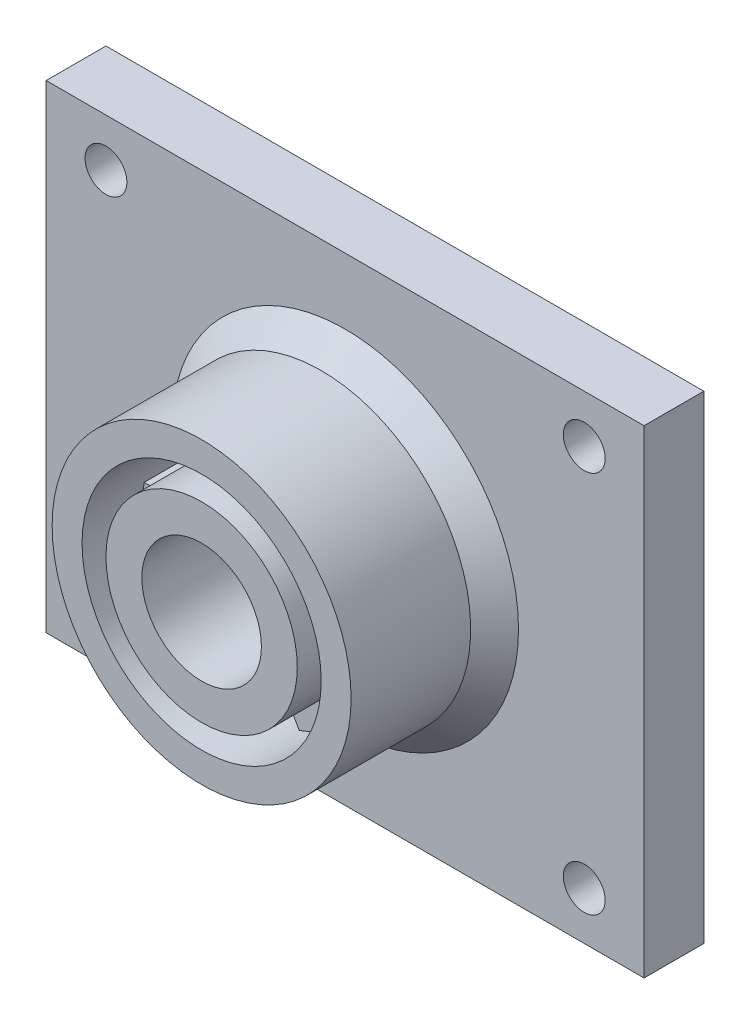
ISO-10303-21;
HEADER;
FILE_DESCRIPTION(('STEP AP214'),'2;1');
FILE_NAME('part.step','',(''),(''),'','','');
FILE_SCHEMA(('AUTOMOTIVE_DESIGN { 1 0 10303 214 1 1 1 1 }'));
ENDSEC;
DATA;
#1=APPLICATION_CONTEXT('core data for automotive mechanical design processes');
#2=APPLICATION_PROTOCOL_DEFINITION('international standard','automotive_design',2000,#1);
#3=PRODUCT_CONTEXT('',#1,'mechanical');
#4=PRODUCT('Part','Part','',(#3));
#5=PRODUCT_RELATED_PRODUCT_CATEGORY('part','',(#4));
#6=PRODUCT_DEFINITION_FORMATION('','',#4);
#7=PRODUCT_DEFINITION_CONTEXT('part definition',#1,'design');
#8=PRODUCT_DEFINITION('design','',#6,#7);
#9=PRODUCT_DEFINITION_SHAPE('','',#8);
#10=(LENGTH_UNIT() NAMED_UNIT(*) SI_UNIT(.MILLI.,.METRE.));
#11=(NAMED_UNIT(*) PLANE_ANGLE_UNIT() SI_UNIT($,.RADIAN.));
#12=(NAMED_UNIT(*) SI_UNIT($,.STERADIAN.) SOLID_ANGLE_UNIT());
#13=UNCERTAINTY_MEASURE_WITH_UNIT(LENGTH_MEASURE(1.E-05),#10,'distance_accuracy_value','');
#14=(GEOMETRIC_REPRESENTATION_CONTEXT(3) GLOBAL_UNCERTAINTY_ASSIGNED_CONTEXT((#13)) GLOBAL_UNIT_ASSIGNED_CONTEXT((#10,
#11,#12)) REPRESENTATION_CONTEXT('',''));
#15=CARTESIAN_POINT('',(0.,0.,0.));
#16=DIRECTION('',(0.,0.,1.));
#17=DIRECTION('',(1.,0.,0.));
#18=AXIS2_PLACEMENT_3D('',#15,#16,#17);
#19=CARTESIAN_POINT('',(0.,0.,9.5));
#20=DIRECTION('',(0.,0.,1.));
#21=DIRECTION('',(1.,0.,0.));
#22=AXIS2_PLACEMENT_3D('',#19,#20,#21);
#23=PLANE('',#22);
#24=DIRECTION('',(-0.499999999999868,0.866025403784515,0.));
#25=VECTOR('',#24,1.);
#26=CARTESIAN_POINT('',(1.73205080756903,0.999999999999735,9.5));
#27=LINE('',#26,#25);
#28=CARTESIAN_POINT('',(6.63103029313409,-7.48528137423958,9.5));
#29=VERTEX_POINT('',#28);
#30=CARTESIAN_POINT('',(5.60503415377542,-5.70820393250023,9.5));
#31=VERTEX_POINT('',#30);
#32=EDGE_CURVE('E508',#29,#31,#27,.T.);
#33=ORIENTED_EDGE('',*,*,#32,.T.);
#34=CARTESIAN_POINT('',(0.,0.,9.5));
#35=DIRECTION('',(0.,0.,1.));
#36=DIRECTION('',(1.,0.,0.));
#37=AXIS2_PLACEMENT_3D('',#34,#35,#36);
#38=CIRCLE('',#37,8.);
#39=CARTESIAN_POINT('',(2.14093253863736,-7.7082039324997,9.5));
#40=VERTEX_POINT('',#39);
#41=EDGE_CURVE('E249',#31,#40,#38,.F.);
#42=ORIENTED_EDGE('',*,*,#41,.T.);
#43=DIRECTION('',(-0.499999999999868,0.866025403784515,0.));
#44=VECTOR('',#43,1.);
#45=CARTESIAN_POINT('',(-1.73205080756903,-0.999999999999738,9.5));
#46=LINE('',#45,#44);
#47=CARTESIAN_POINT('',(3.16692867799603,-9.48528137423905,9.5));
#48=VERTEX_POINT('',#47);
#49=EDGE_CURVE('E505',#48,#40,#46,.T.);
#50=ORIENTED_EDGE('',*,*,#49,.F.);
#51=CARTESIAN_POINT('',(0.,0.,9.5));
#52=DIRECTION('',(0.,0.,1.));
#53=DIRECTION('',(1.,0.,0.));
#54=AXIS2_PLACEMENT_3D('',#51,#52,#53);
#55=CIRCLE('',#54,10.);
#56=EDGE_CURVE('E522',#48,#29,#55,.T.);
#57=ORIENTED_EDGE('',*,*,#56,.T.);
#58=EDGE_LOOP('',(#33,#42,#50,#57));
#59=FACE_BOUND('',#58,.T.);
#60=ADVANCED_FACE('F46',(#59),#23,.T.);
#61=DIRECTION('',(0.500000000000165,0.866025403784344,0.));
#62=VECTOR('',#61,1.);
#63=CARTESIAN_POINT('',(1.73205080756869,-1.00000000000033,9.5));
#64=LINE('',#63,#62);
#65=CARTESIAN_POINT('',(-3.16692867799928,-9.48528137423797,9.5));
#66=VERTEX_POINT('',#65);
#67=CARTESIAN_POINT('',(-2.14093253864,-7.70820393249896,9.5));
#68=VERTEX_POINT('',#67);
#69=EDGE_CURVE('E500',#66,#68,#64,.T.);
#70=ORIENTED_EDGE('',*,*,#69,.T.);
#71=CARTESIAN_POINT('',(-5.60503415377738,-5.7082039324983,9.5));
#72=VERTEX_POINT('',#71);
#73=EDGE_CURVE('E357',#68,#72,#38,.F.);
#74=ORIENTED_EDGE('',*,*,#73,.T.);
#75=DIRECTION('',(0.500000000000166,0.866025403784343,0.));
#76=VECTOR('',#75,1.);
#77=CARTESIAN_POINT('',(-1.73205080756868,1.00000000000033,9.5));
#78=LINE('',#77,#76);
#79=CARTESIAN_POINT('',(-6.63103029313666,-7.48528137423731,9.5));
#80=VERTEX_POINT('',#79);
#81=EDGE_CURVE('E497',#80,#72,#78,.T.);
#82=ORIENTED_EDGE('',*,*,#81,.F.);
#83=EDGE_CURVE('E491',#80,#66,#55,.T.);
#84=ORIENTED_EDGE('',*,*,#83,.T.);
#85=EDGE_LOOP('',(#70,#74,#82,#84));
#86=FACE_BOUND('',#85,.T.);
#87=ADVANCED_FACE('F529',(#86),#23,.T.);
#88=DIRECTION('',(1.,0.,0.));
#89=VECTOR('',#88,1.);
#90=CARTESIAN_POINT('',(0.,-2.,9.5));
#91=LINE('',#90,#89);
#92=CARTESIAN_POINT('',(-9.79795897113271,-2.,9.5));
#93=VERTEX_POINT('',#92);
#94=CARTESIAN_POINT('',(-7.74596669241483,-2.,9.5));
#95=VERTEX_POINT('',#94);
#96=EDGE_CURVE('E450',#93,#95,#91,.T.);
#97=ORIENTED_EDGE('',*,*,#96,.T.);
#98=CARTESIAN_POINT('',(-7.74596669241483,2.,9.5));
#99=VERTEX_POINT('',#98);
#100=EDGE_CURVE('E362',#95,#99,#38,.F.);
#101=ORIENTED_EDGE('',*,*,#100,.T.);
#102=DIRECTION('',(1.,0.,0.));
#103=VECTOR('',#102,1.);
#104=CARTESIAN_POINT('',(0.,2.00000000000001,9.5));
#105=LINE('',#104,#103);
#106=CARTESIAN_POINT('',(-9.79795897113271,2.,9.5));
#107=VERTEX_POINT('',#106);
#108=EDGE_CURVE('E294',#107,#99,#105,.T.);
#109=ORIENTED_EDGE('',*,*,#108,.F.);
#110=EDGE_CURVE('E485',#107,#93,#55,.T.);
#111=ORIENTED_EDGE('',*,*,#110,.T.);
#112=EDGE_LOOP('',(#97,#101,#109,#111));
#113=FACE_BOUND('',#112,.T.);
#114=ADVANCED_FACE('F487',(#113),#23,.T.);
#115=DIRECTION('',(0.499999999999967,-0.866025403784458,0.));
#116=VECTOR('',#115,1.);
#117=CARTESIAN_POINT('',(-1.73205080756891,-0.999999999999931,9.5));
#118=LINE('',#117,#116);
#119=CARTESIAN_POINT('',(-6.63103029313494,7.48528137423883,9.5));
#120=VERTEX_POINT('',#119);
#121=CARTESIAN_POINT('',(-5.60503415377607,5.70820393249959,9.5));
#122=VERTEX_POINT('',#121);
#123=EDGE_CURVE('E398',#120,#122,#118,.T.);
#124=ORIENTED_EDGE('',*,*,#123,.T.);
#125=CARTESIAN_POINT('',(-2.14093253863824,7.70820393249945,9.5));
#126=VERTEX_POINT('',#125);
#127=EDGE_CURVE('E367',#122,#126,#38,.F.);
#128=ORIENTED_EDGE('',*,*,#127,.T.);
#129=DIRECTION('',(0.499999999999967,-0.866025403784458,0.));
#130=VECTOR('',#129,1.);
#131=CARTESIAN_POINT('',(1.73205080756892,0.999999999999939,9.5));
#132=LINE('',#131,#130);
#133=CARTESIAN_POINT('',(-3.16692867799711,9.48528137423869,9.5));
#134=VERTEX_POINT('',#133);
#135=EDGE_CURVE('E392',#134,#126,#132,.T.);
#136=ORIENTED_EDGE('',*,*,#135,.F.);
#137=EDGE_CURVE('E490',#134,#120,#55,.T.);
#138=ORIENTED_EDGE('',*,*,#137,.T.);
#139=EDGE_LOOP('',(#124,#128,#136,#138));
#140=FACE_BOUND('',#139,.T.);
#141=ADVANCED_FACE('F549',(#140),#23,.T.);
#142=DIRECTION('',(-0.500000000000066,-0.866025403784401,0.));
#143=VECTOR('',#142,1.);
#144=CARTESIAN_POINT('',(-1.73205080756879,1.00000000000013,9.5));
#145=LINE('',#144,#143);
#146=CARTESIAN_POINT('',(3.16692867799821,9.48528137423833,9.5));
#147=VERTEX_POINT('',#146);
#148=CARTESIAN_POINT('',(2.14093253863914,7.7082039324992,9.5));
#149=VERTEX_POINT('',#148);
#150=EDGE_CURVE('E383',#147,#149,#145,.T.);
#151=ORIENTED_EDGE('',*,*,#150,.T.);
#152=CARTESIAN_POINT('',(5.60503415377674,5.70820393249893,9.5));
#153=VERTEX_POINT('',#152);
#154=EDGE_CURVE('E246',#149,#153,#38,.F.);
#155=ORIENTED_EDGE('',*,*,#154,.T.);
#156=DIRECTION('',(-0.500000000000066,-0.866025403784401,0.));
#157=VECTOR('',#156,1.);
#158=CARTESIAN_POINT('',(1.73205080756882,-1.00000000000014,9.5));
#159=LINE('',#158,#157);
#160=CARTESIAN_POINT('',(6.63103029313582,7.48528137423805,9.5));
#161=VERTEX_POINT('',#160);
#162=EDGE_CURVE('E256',#161,#153,#159,.T.);
#163=ORIENTED_EDGE('',*,*,#162,.F.);
#164=EDGE_CURVE('E247',#161,#147,#55,.T.);
#165=ORIENTED_EDGE('',*,*,#164,.T.);
#166=EDGE_LOOP('',(#151,#155,#163,#165));
#167=FACE_BOUND('',#166,.T.);
#168=ADVANCED_FACE('F380',(#167),#23,.T.);
#169=CARTESIAN_POINT('',(0.,0.,2.5));
#170=DIRECTION('',(0.,0.,-1.));
#171=DIRECTION('',(-1.,0.,0.));
#172=AXIS2_PLACEMENT_3D('',#169,#170,#171);
#173=PLANE('',#172);
#174=CARTESIAN_POINT('',(0.,0.,2.5));
#175=DIRECTION('',(0.,0.,-1.));
#176=DIRECTION('',(-1.,0.,0.));
#177=AXIS2_PLACEMENT_3D('',#174,#175,#176);
#178=CIRCLE('',#177,14.5);
#179=CARTESIAN_POINT('',(-14.5,0.,2.5));
#180=VERTEX_POINT('',#179);
#181=EDGE_CURVE('E12',#180,#180,#178,.T.);
#182=ORIENTED_EDGE('',*,*,#181,.T.);
#183=EDGE_LOOP('',(#182));
#184=FACE_BOUND('',#183,.T.);
#185=DIRECTION('',(0.,1.,0.));
#186=VECTOR('',#185,1.);
#187=CARTESIAN_POINT('',(25.,-20.,2.5));
#188=LINE('',#187,#186);
#189=CARTESIAN_POINT('',(25.,-20.,2.5));
#190=VERTEX_POINT('',#189);
#191=CARTESIAN_POINT('',(25.,20.,2.5));
#192=VERTEX_POINT('',#191);
#193=EDGE_CURVE('E326',#190,#192,#188,.T.);
#194=ORIENTED_EDGE('',*,*,#193,.T.);
#195=DIRECTION('',(-1.,0.,0.));
#196=VECTOR('',#195,1.);
#197=CARTESIAN_POINT('',(-25.,20.,2.5));
#198=LINE('',#197,#196);
#199=CARTESIAN_POINT('',(-25.,20.,2.5));
#200=VERTEX_POINT('',#199);
#201=EDGE_CURVE('E329',#192,#200,#198,.T.);
#202=ORIENTED_EDGE('',*,*,#201,.T.);
#203=DIRECTION('',(0.,-1.,0.));
#204=VECTOR('',#203,1.);
#205=CARTESIAN_POINT('',(-25.,-20.,2.5));
#206=LINE('',#205,#204);
#207=CARTESIAN_POINT('',(-25.,-20.,2.5));
#208=VERTEX_POINT('',#207);
#209=EDGE_CURVE('E332',#200,#208,#206,.T.);
#210=ORIENTED_EDGE('',*,*,#209,.T.);
#211=DIRECTION('',(1.,0.,0.));
#212=VECTOR('',#211,1.);
#213=CARTESIAN_POINT('',(-25.,-20.,2.5));
#214=LINE('',#213,#212);
#215=EDGE_CURVE('E334',#208,#190,#214,.T.);
#216=ORIENTED_EDGE('',*,*,#215,.T.);
#217=EDGE_LOOP('',(#194,#202,#210,#216));
#218=FACE_BOUND('',#217,.T.);
#219=CARTESIAN_POINT('',(-20.,16.,2.5));
#220=DIRECTION('',(0.,0.,1.));
#221=DIRECTION('',(1.,0.,0.));
#222=AXIS2_PLACEMENT_3D('',#219,#220,#221);
#223=CIRCLE('',#222,1.75);
#224=CARTESIAN_POINT('',(-18.25,16.,2.5));
#225=VERTEX_POINT('',#224);
#226=EDGE_CURVE('E320',#225,#225,#223,.T.);
#227=ORIENTED_EDGE('',*,*,#226,.F.);
#228=EDGE_LOOP('',(#227));
#229=FACE_BOUND('',#228,.T.);
#230=CARTESIAN_POINT('',(20.,16.,2.5));
#231=DIRECTION('',(0.,0.,1.));
#232=DIRECTION('',(1.,0.,0.));
#233=AXIS2_PLACEMENT_3D('',#230,#231,#232);
#234=CIRCLE('',#233,1.75);
#235=CARTESIAN_POINT('',(21.75,16.,2.5));
#236=VERTEX_POINT('',#235);
#237=EDGE_CURVE('E314',#236,#236,#234,.T.);
#238=ORIENTED_EDGE('',*,*,#237,.F.);
#239=EDGE_LOOP('',(#238));
#240=FACE_BOUND('',#239,.T.);
#241=CARTESIAN_POINT('',(20.,-16.,2.5));
#242=DIRECTION('',(0.,0.,1.));
#243=DIRECTION('',(1.,0.,0.));
#244=AXIS2_PLACEMENT_3D('',#241,#242,#243);
#245=CIRCLE('',#244,1.75);
#246=CARTESIAN_POINT('',(21.75,-16.,2.5));
#247=VERTEX_POINT('',#246);
#248=EDGE_CURVE('E308',#247,#247,#245,.T.);
#249=ORIENTED_EDGE('',*,*,#248,.F.);
#250=EDGE_LOOP('',(#249));
#251=FACE_BOUND('',#250,.T.);
#252=CARTESIAN_POINT('',(-20.,-16.,2.5));
#253=DIRECTION('',(0.,0.,1.));
#254=DIRECTION('',(1.,0.,0.));
#255=AXIS2_PLACEMENT_3D('',#252,#253,#254);
#256=CIRCLE('',#255,1.75);
#257=CARTESIAN_POINT('',(-18.25,-16.,2.5));
#258=VERTEX_POINT('',#257);
#259=EDGE_CURVE('E300',#258,#258,#256,.T.);
#260=ORIENTED_EDGE('',*,*,#259,.F.);
#261=EDGE_LOOP('',(#260));
#262=FACE_BOUND('',#261,.T.);
#263=ADVANCED_FACE('F548',(#184,#218,#229,#240,#251,#262),#173,.F.);
#264=CARTESIAN_POINT('',(0.,0.,-2.5));
#265=DIRECTION('',(0.,0.,-1.));
#266=DIRECTION('',(-1.,0.,0.));
#267=AXIS2_PLACEMENT_3D('',#264,#265,#266);
#268=PLANE('',#267);
#269=CARTESIAN_POINT('',(20.,-16.,-2.5));
#270=DIRECTION('',(0.,0.,1.));
#271=DIRECTION('',(1.,0.,0.));
#272=AXIS2_PLACEMENT_3D('',#269,#270,#271);
#273=CIRCLE('',#272,1.75);
#274=CARTESIAN_POINT('',(21.75,-16.,-2.5));
#275=VERTEX_POINT('',#274);
#276=EDGE_CURVE('E303',#275,#275,#273,.T.);
#277=ORIENTED_EDGE('',*,*,#276,.T.);
#278=EDGE_LOOP('',(#277));
#279=FACE_BOUND('',#278,.T.);
#280=CARTESIAN_POINT('',(-20.,16.,-2.5));
#281=DIRECTION('',(0.,0.,1.));
#282=DIRECTION('',(1.,0.,0.));
#283=AXIS2_PLACEMENT_3D('',#280,#281,#282);
#284=CIRCLE('',#283,1.75);
#285=CARTESIAN_POINT('',(-18.25,16.,-2.5));
#286=VERTEX_POINT('',#285);
#287=EDGE_CURVE('E317',#286,#286,#284,.T.);
#288=ORIENTED_EDGE('',*,*,#287,.T.);
#289=EDGE_LOOP('',(#288));
#290=FACE_BOUND('',#289,.T.);
#291=DIRECTION('',(0.,1.,0.));
#292=VECTOR('',#291,1.);
#293=CARTESIAN_POINT('',(25.,-20.,-2.5));
#294=LINE('',#293,#292);
#295=CARTESIAN_POINT('',(25.,-20.,-2.5));
#296=VERTEX_POINT('',#295);
#297=CARTESIAN_POINT('',(25.,20.,-2.5));
#298=VERTEX_POINT('',#297);
#299=EDGE_CURVE('E323',#296,#298,#294,.T.);
#300=ORIENTED_EDGE('',*,*,#299,.F.);
#301=DIRECTION('',(1.,0.,0.));
#302=VECTOR('',#301,1.);
#303=CARTESIAN_POINT('',(-25.,-20.,-2.5));
#304=LINE('',#303,#302);
#305=CARTESIAN_POINT('',(-25.,-20.,-2.5));
#306=VERTEX_POINT('',#305);
#307=EDGE_CURVE('E330',#306,#296,#304,.T.);
#308=ORIENTED_EDGE('',*,*,#307,.F.);
#309=DIRECTION('',(0.,-1.,0.));
#310=VECTOR('',#309,1.);
#311=CARTESIAN_POINT('',(-25.,-20.,-2.5));
#312=LINE('',#311,#310);
#313=CARTESIAN_POINT('',(-25.,20.,-2.5));
#314=VERTEX_POINT('',#313);
#315=EDGE_CURVE('E341',#314,#306,#312,.T.);
#316=ORIENTED_EDGE('',*,*,#315,.F.);
#317=DIRECTION('',(-1.,0.,0.));
#318=VECTOR('',#317,1.);
#319=CARTESIAN_POINT('',(-25.,20.,-2.5));
#320=LINE('',#319,#318);
#321=EDGE_CURVE('E339',#298,#314,#320,.T.);
#322=ORIENTED_EDGE('',*,*,#321,.F.);
#323=EDGE_LOOP('',(#300,#308,#316,#322));
#324=FACE_BOUND('',#323,.T.);
#325=CARTESIAN_POINT('',(20.,16.,-2.5));
#326=DIRECTION('',(0.,0.,1.));
#327=DIRECTION('',(1.,0.,0.));
#328=AXIS2_PLACEMENT_3D('',#325,#326,#327);
#329=CIRCLE('',#328,1.75);
#330=CARTESIAN_POINT('',(21.75,16.,-2.5));
#331=VERTEX_POINT('',#330);
#332=EDGE_CURVE('E311',#331,#331,#329,.T.);
#333=ORIENTED_EDGE('',*,*,#332,.T.);
#334=EDGE_LOOP('',(#333));
#335=FACE_BOUND('',#334,.T.);
#336=CARTESIAN_POINT('',(-20.,-16.,-2.5));
#337=DIRECTION('',(0.,0.,1.));
#338=DIRECTION('',(1.,0.,0.));
#339=AXIS2_PLACEMENT_3D('',#336,#337,#338);
#340=CIRCLE('',#339,1.75);
#341=CARTESIAN_POINT('',(-18.25,-16.,-2.5));
#342=VERTEX_POINT('',#341);
#343=EDGE_CURVE('E304',#342,#342,#340,.T.);
#344=ORIENTED_EDGE('',*,*,#343,.T.);
#345=EDGE_LOOP('',(#344));
#346=FACE_BOUND('',#345,.T.);
#347=ADVANCED_FACE('F554',(#279,#290,#324,#335,#346),#268,.T.);
#348=CARTESIAN_POINT('',(25.,-20.,2.5));
#349=DIRECTION('',(-1.,0.,0.));
#350=DIRECTION('',(0.,0.,1.));
#351=AXIS2_PLACEMENT_3D('',#348,#349,#350);
#352=PLANE('',#351);
#353=ORIENTED_EDGE('',*,*,#299,.T.);
#354=DIRECTION('',(0.,0.,-1.));
#355=VECTOR('',#354,1.);
#356=CARTESIAN_POINT('',(25.,20.,2.5));
#357=LINE('',#356,#355);
#358=EDGE_CURVE('E352',#192,#298,#357,.T.);
#359=ORIENTED_EDGE('',*,*,#358,.F.);
#360=ORIENTED_EDGE('',*,*,#193,.F.);
#361=DIRECTION('',(0.,0.,-1.));
#362=VECTOR('',#361,1.);
#363=CARTESIAN_POINT('',(25.,-20.,2.5));
#364=LINE('',#363,#362);
#365=EDGE_CURVE('E336',#190,#296,#364,.T.);
#366=ORIENTED_EDGE('',*,*,#365,.T.);
#367=EDGE_LOOP('',(#353,#359,#360,#366));
#368=FACE_BOUND('',#367,.T.);
#369=ADVANCED_FACE('F676',(#368),#352,.F.);
#370=CARTESIAN_POINT('',(-25.,20.,2.5));
#371=DIRECTION('',(0.,-1.,0.));
#372=DIRECTION('',(0.,0.,-1.));
#373=AXIS2_PLACEMENT_3D('',#370,#371,#372);
#374=PLANE('',#373);
#375=ORIENTED_EDGE('',*,*,#321,.T.);
#376=DIRECTION('',(0.,0.,-1.));
#377=VECTOR('',#376,1.);
#378=CARTESIAN_POINT('',(-25.,20.,2.5));
#379=LINE('',#378,#377);
#380=EDGE_CURVE('E349',#200,#314,#379,.T.);
#381=ORIENTED_EDGE('',*,*,#380,.F.);
#382=ORIENTED_EDGE('',*,*,#201,.F.);
#383=ORIENTED_EDGE('',*,*,#358,.T.);
#384=EDGE_LOOP('',(#375,#381,#382,#383));
#385=FACE_BOUND('',#384,.T.);
#386=ADVANCED_FACE('F697',(#385),#374,.F.);
#387=CARTESIAN_POINT('',(-25.,-20.,2.5));
#388=DIRECTION('',(1.,0.,0.));
#389=DIRECTION('',(0.,0.,-1.));
#390=AXIS2_PLACEMENT_3D('',#387,#388,#389);
#391=PLANE('',#390);
#392=ORIENTED_EDGE('',*,*,#315,.T.);
#393=DIRECTION('',(0.,0.,-1.));
#394=VECTOR('',#393,1.);
#395=CARTESIAN_POINT('',(-25.,-20.,2.5));
#396=LINE('',#395,#394);
#397=EDGE_CURVE('E346',#208,#306,#396,.T.);
#398=ORIENTED_EDGE('',*,*,#397,.F.);
#399=ORIENTED_EDGE('',*,*,#209,.F.);
#400=ORIENTED_EDGE('',*,*,#380,.T.);
#401=EDGE_LOOP('',(#392,#398,#399,#400));
#402=FACE_BOUND('',#401,.T.);
#403=ADVANCED_FACE('F667',(#402),#391,.F.);
#404=CARTESIAN_POINT('',(-25.,-20.,2.5));
#405=DIRECTION('',(0.,1.,0.));
#406=DIRECTION('',(0.,0.,1.));
#407=AXIS2_PLACEMENT_3D('',#404,#405,#406);
#408=PLANE('',#407);
#409=ORIENTED_EDGE('',*,*,#307,.T.);
#410=ORIENTED_EDGE('',*,*,#365,.F.);
#411=ORIENTED_EDGE('',*,*,#215,.F.);
#412=ORIENTED_EDGE('',*,*,#397,.T.);
#413=EDGE_LOOP('',(#409,#410,#411,#412));
#414=FACE_BOUND('',#413,.T.);
#415=ADVANCED_FACE('F662',(#414),#408,.F.);
#416=CARTESIAN_POINT('',(-20.,16.,2.5));
#417=DIRECTION('',(0.,0.,-1.));
#418=DIRECTION('',(-1.,0.,0.));
#419=AXIS2_PLACEMENT_3D('',#416,#417,#418);
#420=CYLINDRICAL_SURFACE('',#419,1.75);
#421=ORIENTED_EDGE('',*,*,#226,.T.);
#422=EDGE_LOOP('',(#421));
#423=FACE_BOUND('',#422,.T.);
#424=ORIENTED_EDGE('',*,*,#287,.F.);
#425=EDGE_LOOP('',(#424));
#426=FACE_BOUND('',#425,.T.);
#427=ADVANCED_FACE('F659',(#423,#426),#420,.F.);
#428=CARTESIAN_POINT('',(20.,16.,2.5));
#429=DIRECTION('',(0.,0.,-1.));
#430=DIRECTION('',(-1.,0.,0.));
#431=AXIS2_PLACEMENT_3D('',#428,#429,#430);
#432=CYLINDRICAL_SURFACE('',#431,1.75);
#433=ORIENTED_EDGE('',*,*,#237,.T.);
#434=EDGE_LOOP('',(#433));
#435=FACE_BOUND('',#434,.T.);
#436=ORIENTED_EDGE('',*,*,#332,.F.);
#437=EDGE_LOOP('',(#436));
#438=FACE_BOUND('',#437,.T.);
#439=ADVANCED_FACE('F656',(#435,#438),#432,.F.);
#440=CARTESIAN_POINT('',(20.,-16.,2.5));
#441=DIRECTION('',(0.,0.,-1.));
#442=DIRECTION('',(-1.,0.,0.));
#443=AXIS2_PLACEMENT_3D('',#440,#441,#442);
#444=CYLINDRICAL_SURFACE('',#443,1.75);
#445=ORIENTED_EDGE('',*,*,#248,.T.);
#446=EDGE_LOOP('',(#445));
#447=FACE_BOUND('',#446,.T.);
#448=ORIENTED_EDGE('',*,*,#276,.F.);
#449=EDGE_LOOP('',(#448));
#450=FACE_BOUND('',#449,.T.);
#451=ADVANCED_FACE('F624',(#447,#450),#444,.F.);
#452=CARTESIAN_POINT('',(-20.,-16.,2.5));
#453=DIRECTION('',(0.,0.,-1.));
#454=DIRECTION('',(-1.,0.,0.));
#455=AXIS2_PLACEMENT_3D('',#452,#453,#454);
#456=CYLINDRICAL_SURFACE('',#455,1.75);
#457=ORIENTED_EDGE('',*,*,#259,.T.);
#458=EDGE_LOOP('',(#457));
#459=FACE_BOUND('',#458,.T.);
#460=ORIENTED_EDGE('',*,*,#343,.F.);
#461=EDGE_LOOP('',(#460));
#462=FACE_BOUND('',#461,.T.);
#463=ADVANCED_FACE('F617',(#459,#462),#456,.F.);
#464=CARTESIAN_POINT('',(0.,0.,9.5));
#465=DIRECTION('',(0.,0.,-1.));
#466=DIRECTION('',(-1.,0.,0.));
#467=AXIS2_PLACEMENT_3D('',#464,#465,#466);
#468=CYLINDRICAL_SURFACE('',#467,12.5);
#469=CARTESIAN_POINT('',(0.,0.,4.50000000000002));
#470=DIRECTION('',(0.,0.,-1.));
#471=DIRECTION('',(-1.,0.,0.));
#472=AXIS2_PLACEMENT_3D('',#469,#470,#471);
#473=CIRCLE('',#472,12.5);
#474=CARTESIAN_POINT('',(-12.5,0.,4.50000000000002));
#475=VERTEX_POINT('',#474);
#476=EDGE_CURVE('E54',#475,#475,#473,.F.);
#477=ORIENTED_EDGE('',*,*,#476,.T.);
#478=EDGE_LOOP('',(#477));
#479=FACE_BOUND('',#478,.T.);
#480=CARTESIAN_POINT('',(0.,0.,14.5));
#481=DIRECTION('',(0.,0.,1.));
#482=DIRECTION('',(1.,0.,0.));
#483=AXIS2_PLACEMENT_3D('',#480,#481,#482);
#484=CIRCLE('',#483,12.5);
#485=CARTESIAN_POINT('',(12.5,0.,14.5));
#486=VERTEX_POINT('',#485);
#487=EDGE_CURVE('E406',#486,#486,#484,.T.);
#488=ORIENTED_EDGE('',*,*,#487,.F.);
#489=EDGE_LOOP('',(#488));
#490=FACE_BOUND('',#489,.T.);
#491=ADVANCED_FACE('F615',(#479,#490),#468,.T.);
#492=CARTESIAN_POINT('',(0.,0.,14.5));
#493=DIRECTION('',(0.,0.,1.));
#494=DIRECTION('',(1.,0.,0.));
#495=AXIS2_PLACEMENT_3D('',#492,#493,#494);
#496=PLANE('',#495);
#497=CARTESIAN_POINT('',(0.,0.,14.5));
#498=DIRECTION('',(0.,0.,1.));
#499=DIRECTION('',(1.,0.,0.));
#500=AXIS2_PLACEMENT_3D('',#497,#498,#499);
#501=CIRCLE('',#500,10.);
#502=CARTESIAN_POINT('',(10.,0.,14.5));
#503=VERTEX_POINT('',#502);
#504=EDGE_CURVE('E606',#503,#503,#501,.T.);
#505=ORIENTED_EDGE('',*,*,#504,.F.);
#506=EDGE_LOOP('',(#505));
#507=FACE_BOUND('',#506,.T.);
#508=ORIENTED_EDGE('',*,*,#487,.T.);
#509=EDGE_LOOP('',(#508));
#510=FACE_BOUND('',#509,.T.);
#511=ADVANCED_FACE('F613',(#507,#510),#496,.T.);
#512=DIRECTION('',(-1.,1.14338320158036E-13,0.));
#513=VECTOR('',#512,1.);
#514=CARTESIAN_POINT('',(2.28676640316071E-13,1.99999999999999,2.5));
#515=LINE('',#514,#513);
#516=CARTESIAN_POINT('',(9.79795897113295,1.99999999999887,2.5));
#517=VERTEX_POINT('',#516);
#518=CARTESIAN_POINT('',(7.74596669241507,1.9999999999991,2.5));
#519=VERTEX_POINT('',#518);
#520=EDGE_CURVE('E261',#517,#519,#515,.T.);
#521=ORIENTED_EDGE('',*,*,#520,.F.);
#522=CARTESIAN_POINT('',(0.,0.,2.5));
#523=DIRECTION('',(0.,0.,1.));
#524=DIRECTION('',(1.,0.,0.));
#525=AXIS2_PLACEMENT_3D('',#522,#523,#524);
#526=CIRCLE('',#525,10.);
#527=CARTESIAN_POINT('',(6.63103029313581,7.48528137423806,2.5));
#528=VERTEX_POINT('',#527);
#529=EDGE_CURVE('E436',#517,#528,#526,.T.);
#530=ORIENTED_EDGE('',*,*,#529,.T.);
#531=DIRECTION('',(-0.500000000000066,-0.866025403784401,0.));
#532=VECTOR('',#531,1.);
#533=CARTESIAN_POINT('',(1.73205080756882,-1.00000000000014,2.5));
#534=LINE('',#533,#532);
#535=CARTESIAN_POINT('',(5.60503415377674,5.70820393249893,2.5));
#536=VERTEX_POINT('',#535);
#537=EDGE_CURVE('E434',#528,#536,#534,.T.);
#538=ORIENTED_EDGE('',*,*,#537,.T.);
#539=CARTESIAN_POINT('',(0.,0.,2.5));
#540=DIRECTION('',(0.,0.,1.));
#541=DIRECTION('',(1.,0.,0.));
#542=AXIS2_PLACEMENT_3D('',#539,#540,#541);
#543=CIRCLE('',#542,8.);
#544=EDGE_CURVE('E385',#519,#536,#543,.T.);
#545=ORIENTED_EDGE('',*,*,#544,.F.);
#546=EDGE_LOOP('',(#521,#530,#538,#545));
#547=FACE_BOUND('',#546,.T.);
#548=ADVANCED_FACE('F471',(#547),#173,.F.);
#549=DIRECTION('',(-0.500000000000066,-0.866025403784401,0.));
#550=VECTOR('',#549,1.);
#551=CARTESIAN_POINT('',(-1.73205080756879,1.00000000000013,2.5));
#552=LINE('',#551,#550);
#553=CARTESIAN_POINT('',(3.16692867799821,9.48528137423833,2.5));
#554=VERTEX_POINT('',#553);
#555=CARTESIAN_POINT('',(2.14093253863914,7.7082039324992,2.5));
#556=VERTEX_POINT('',#555);
#557=EDGE_CURVE('E437',#554,#556,#552,.T.);
#558=ORIENTED_EDGE('',*,*,#557,.F.);
#559=CARTESIAN_POINT('',(-3.16692867799711,9.48528137423869,2.5));
#560=VERTEX_POINT('',#559);
#561=EDGE_CURVE('E442',#554,#560,#526,.T.);
#562=ORIENTED_EDGE('',*,*,#561,.T.);
#563=DIRECTION('',(0.499999999999967,-0.866025403784458,0.));
#564=VECTOR('',#563,1.);
#565=CARTESIAN_POINT('',(1.73205080756892,0.999999999999939,2.5));
#566=LINE('',#565,#564);
#567=CARTESIAN_POINT('',(-2.14093253863824,7.70820393249945,2.5));
#568=VERTEX_POINT('',#567);
#569=EDGE_CURVE('E69',#560,#568,#566,.T.);
#570=ORIENTED_EDGE('',*,*,#569,.T.);
#571=EDGE_CURVE('E440',#556,#568,#543,.T.);
#572=ORIENTED_EDGE('',*,*,#571,.F.);
#573=EDGE_LOOP('',(#558,#562,#570,#572));
#574=FACE_BOUND('',#573,.T.);
#575=ADVANCED_FACE('F568',(#574),#173,.F.);
#576=DIRECTION('',(0.499999999999967,-0.866025403784458,0.));
#577=VECTOR('',#576,1.);
#578=CARTESIAN_POINT('',(-1.73205080756891,-0.999999999999931,2.5));
#579=LINE('',#578,#577);
#580=CARTESIAN_POINT('',(-6.63103029313494,7.48528137423883,2.5));
#581=VERTEX_POINT('',#580);
#582=CARTESIAN_POINT('',(-5.60503415377607,5.70820393249959,2.5));
#583=VERTEX_POINT('',#582);
#584=EDGE_CURVE('E443',#581,#583,#579,.T.);
#585=ORIENTED_EDGE('',*,*,#584,.F.);
#586=CARTESIAN_POINT('',(-9.79795897113271,2.,2.5));
#587=VERTEX_POINT('',#586);
#588=EDGE_CURVE('E418',#581,#587,#526,.T.);
#589=ORIENTED_EDGE('',*,*,#588,.T.);
#590=DIRECTION('',(1.,0.,0.));
#591=VECTOR('',#590,1.);
#592=CARTESIAN_POINT('',(0.,2.00000000000001,2.5));
#593=LINE('',#592,#591);
#594=CARTESIAN_POINT('',(-7.74596669241484,2.,2.5));
#595=VERTEX_POINT('',#594);
#596=EDGE_CURVE('E61',#587,#595,#593,.T.);
#597=ORIENTED_EDGE('',*,*,#596,.T.);
#598=EDGE_CURVE('E410',#583,#595,#543,.T.);
#599=ORIENTED_EDGE('',*,*,#598,.F.);
#600=EDGE_LOOP('',(#585,#589,#597,#599));
#601=FACE_BOUND('',#600,.T.);
#602=ADVANCED_FACE('F480',(#601),#173,.F.);
#603=DIRECTION('',(1.,0.,0.));
#604=VECTOR('',#603,1.);
#605=CARTESIAN_POINT('',(0.,-2.,2.5));
#606=LINE('',#605,#604);
#607=CARTESIAN_POINT('',(-9.79795897113271,-2.,2.5));
#608=VERTEX_POINT('',#607);
#609=CARTESIAN_POINT('',(-7.74596669241483,-2.,2.5));
#610=VERTEX_POINT('',#609);
#611=EDGE_CURVE('E402',#608,#610,#606,.T.);
#612=ORIENTED_EDGE('',*,*,#611,.F.);
#613=CARTESIAN_POINT('',(-6.63103029313666,-7.48528137423731,2.5));
#614=VERTEX_POINT('',#613);
#615=EDGE_CURVE('E414',#608,#614,#526,.T.);
#616=ORIENTED_EDGE('',*,*,#615,.T.);
#617=DIRECTION('',(0.500000000000166,0.866025403784343,0.));
#618=VECTOR('',#617,1.);
#619=CARTESIAN_POINT('',(-1.73205080756868,1.00000000000033,2.5));
#620=LINE('',#619,#618);
#621=CARTESIAN_POINT('',(-5.60503415377738,-5.70820393249831,2.5));
#622=VERTEX_POINT('',#621);
#623=EDGE_CURVE('E409',#614,#622,#620,.T.);
#624=ORIENTED_EDGE('',*,*,#623,.T.);
#625=EDGE_CURVE('E405',#610,#622,#543,.T.);
#626=ORIENTED_EDGE('',*,*,#625,.F.);
#627=EDGE_LOOP('',(#612,#616,#624,#626));
#628=FACE_BOUND('',#627,.T.);
#629=ADVANCED_FACE('F557',(#628),#173,.F.);
#630=DIRECTION('',(0.500000000000165,0.866025403784344,0.));
#631=VECTOR('',#630,1.);
#632=CARTESIAN_POINT('',(1.73205080756869,-1.00000000000033,2.5));
#633=LINE('',#632,#631);
#634=CARTESIAN_POINT('',(-3.16692867799929,-9.48528137423797,2.5));
#635=VERTEX_POINT('',#634);
#636=CARTESIAN_POINT('',(-2.14093253864001,-7.70820393249897,2.5));
#637=VERTEX_POINT('',#636);
#638=EDGE_CURVE('E417',#635,#637,#633,.T.);
#639=ORIENTED_EDGE('',*,*,#638,.F.);
#640=CARTESIAN_POINT('',(3.16692867799603,-9.48528137423905,2.5));
#641=VERTEX_POINT('',#640);
#642=EDGE_CURVE('E419',#635,#641,#526,.T.);
#643=ORIENTED_EDGE('',*,*,#642,.T.);
#644=DIRECTION('',(-0.499999999999868,0.866025403784515,0.));
#645=VECTOR('',#644,1.);
#646=CARTESIAN_POINT('',(-1.73205080756903,-0.999999999999738,2.5));
#647=LINE('',#646,#645);
#648=CARTESIAN_POINT('',(2.14093253863737,-7.7082039324997,2.5));
#649=VERTEX_POINT('',#648);
#650=EDGE_CURVE('E422',#641,#649,#647,.T.);
#651=ORIENTED_EDGE('',*,*,#650,.T.);
#652=EDGE_CURVE('E411',#637,#649,#543,.T.);
#653=ORIENTED_EDGE('',*,*,#652,.F.);
#654=EDGE_LOOP('',(#639,#643,#651,#653));
#655=FACE_BOUND('',#654,.T.);
#656=ADVANCED_FACE('F574',(#655),#173,.F.);
#657=DIRECTION('',(-0.499999999999868,0.866025403784515,0.));
#658=VECTOR('',#657,1.);
#659=CARTESIAN_POINT('',(1.73205080756903,0.999999999999735,2.5));
#660=LINE('',#659,#658);
#661=CARTESIAN_POINT('',(6.63103029313409,-7.48528137423959,2.5));
#662=VERTEX_POINT('',#661);
#663=CARTESIAN_POINT('',(5.60503415377543,-5.70820393250023,2.5));
#664=VERTEX_POINT('',#663);
#665=EDGE_CURVE('E425',#662,#664,#660,.T.);
#666=ORIENTED_EDGE('',*,*,#665,.F.);
#667=CARTESIAN_POINT('',(9.79795897113248,-2.00000000000113,2.5));
#668=VERTEX_POINT('',#667);
#669=EDGE_CURVE('E432',#662,#668,#526,.T.);
#670=ORIENTED_EDGE('',*,*,#669,.T.);
#671=DIRECTION('',(-1.,1.14338320158036E-13,0.));
#672=VECTOR('',#671,1.);
#673=CARTESIAN_POINT('',(-2.28676640316074E-13,-2.00000000000001,2.5));
#674=LINE('',#673,#672);
#675=CARTESIAN_POINT('',(7.74596669241461,-2.0000000000009,2.5));
#676=VERTEX_POINT('',#675);
#677=EDGE_CURVE('E429',#668,#676,#674,.T.);
#678=ORIENTED_EDGE('',*,*,#677,.T.);
#679=EDGE_CURVE('E428',#664,#676,#543,.T.);
#680=ORIENTED_EDGE('',*,*,#679,.F.);
#681=EDGE_LOOP('',(#666,#670,#678,#680));
#682=FACE_BOUND('',#681,.T.);
#683=ADVANCED_FACE('F516',(#682),#173,.F.);
#684=CARTESIAN_POINT('',(2.28676640316071E-13,1.99999999999999,9.5));
#685=DIRECTION('',(-1.14338320158036E-13,-1.,0.));
#686=DIRECTION('',(1.,-1.14338320158036E-13,0.));
#687=AXIS2_PLACEMENT_3D('',#684,#685,#686);
#688=PLANE('',#687);
#689=ORIENTED_EDGE('',*,*,#520,.T.);
#690=DIRECTION('',(0.,0.,-1.));
#691=VECTOR('',#690,1.);
#692=CARTESIAN_POINT('',(7.74596669241507,1.9999999999991,9.5));
#693=LINE('',#692,#691);
#694=CARTESIAN_POINT('',(7.74596669241506,1.9999999999991,9.5));
#695=VERTEX_POINT('',#694);
#696=EDGE_CURVE('E239',#695,#519,#693,.T.);
#697=ORIENTED_EDGE('',*,*,#696,.F.);
#698=DIRECTION('',(-1.,1.14338320158036E-13,0.));
#699=VECTOR('',#698,1.);
#700=CARTESIAN_POINT('',(2.28676640316071E-13,1.99999999999999,9.5));
#701=LINE('',#700,#699);
#702=CARTESIAN_POINT('',(9.79795897113295,1.99999999999887,9.5));
#703=VERTEX_POINT('',#702);
#704=EDGE_CURVE('E251',#703,#695,#701,.T.);
#705=ORIENTED_EDGE('',*,*,#704,.F.);
#706=DIRECTION('',(0.,0.,-1.));
#707=VECTOR('',#706,1.);
#708=CARTESIAN_POINT('',(9.79795897113295,1.99999999999887,9.5));
#709=LINE('',#708,#707);
#710=EDGE_CURVE('E281',#703,#517,#709,.T.);
#711=ORIENTED_EDGE('',*,*,#710,.T.);
#712=EDGE_LOOP('',(#689,#697,#705,#711));
#713=FACE_BOUND('',#712,.T.);
#714=ADVANCED_FACE('F259',(#713),#688,.F.);
#715=CARTESIAN_POINT('',(-2.28676640316074E-13,-2.00000000000001,9.5));
#716=DIRECTION('',(-1.14338320158036E-13,-1.,0.));
#717=DIRECTION('',(1.,-1.14338320158036E-13,0.));
#718=AXIS2_PLACEMENT_3D('',#715,#716,#717);
#719=PLANE('',#718);
#720=ORIENTED_EDGE('',*,*,#677,.F.);
#721=DIRECTION('',(0.,0.,-1.));
#722=VECTOR('',#721,1.);
#723=CARTESIAN_POINT('',(9.79795897113249,-2.00000000000113,9.5));
#724=LINE('',#723,#722);
#725=CARTESIAN_POINT('',(9.79795897113248,-2.00000000000113,9.5));
#726=VERTEX_POINT('',#725);
#727=EDGE_CURVE('E274',#726,#668,#724,.T.);
#728=ORIENTED_EDGE('',*,*,#727,.F.);
#729=DIRECTION('',(-1.,1.14338320158036E-13,0.));
#730=VECTOR('',#729,1.);
#731=CARTESIAN_POINT('',(-2.28676640316074E-13,-2.00000000000001,9.5));
#732=LINE('',#731,#730);
#733=CARTESIAN_POINT('',(7.74596669241461,-2.0000000000009,9.5));
#734=VERTEX_POINT('',#733);
#735=EDGE_CURVE('E257',#726,#734,#732,.T.);
#736=ORIENTED_EDGE('',*,*,#735,.T.);
#737=DIRECTION('',(0.,0.,-1.));
#738=VECTOR('',#737,1.);
#739=CARTESIAN_POINT('',(7.74596669241461,-2.0000000000009,9.5));
#740=LINE('',#739,#738);
#741=EDGE_CURVE('E242',#734,#676,#740,.T.);
#742=ORIENTED_EDGE('',*,*,#741,.T.);
#743=EDGE_LOOP('',(#720,#728,#736,#742));
#744=FACE_BOUND('',#743,.T.);
#745=ADVANCED_FACE('F511',(#744),#719,.T.);
#746=CARTESIAN_POINT('',(1.73205080756903,0.999999999999735,9.5));
#747=DIRECTION('',(-0.866025403784515,-0.499999999999868,0.));
#748=DIRECTION('',(0.499999999999868,-0.866025403784515,0.));
#749=AXIS2_PLACEMENT_3D('',#746,#747,#748);
#750=PLANE('',#749);
#751=ORIENTED_EDGE('',*,*,#665,.T.);
#752=DIRECTION('',(0.,0.,-1.));
#753=VECTOR('',#752,1.);
#754=CARTESIAN_POINT('',(5.60503415377543,-5.70820393250023,9.5));
#755=LINE('',#754,#753);
#756=EDGE_CURVE('E279',#31,#664,#755,.T.);
#757=ORIENTED_EDGE('',*,*,#756,.F.);
#758=ORIENTED_EDGE('',*,*,#32,.F.);
#759=DIRECTION('',(0.,0.,-1.));
#760=VECTOR('',#759,1.);
#761=CARTESIAN_POINT('',(6.63103029313409,-7.48528137423959,9.5));
#762=LINE('',#761,#760);
#763=EDGE_CURVE('E272',#29,#662,#762,.T.);
#764=ORIENTED_EDGE('',*,*,#763,.T.);
#765=EDGE_LOOP('',(#751,#757,#758,#764));
#766=FACE_BOUND('',#765,.T.);
#767=ADVANCED_FACE('F520',(#766),#750,.F.);
#768=CARTESIAN_POINT('',(-1.73205080756903,-0.999999999999738,9.5));
#769=DIRECTION('',(-0.866025403784515,-0.499999999999868,0.));
#770=DIRECTION('',(0.499999999999868,-0.866025403784515,0.));
#771=AXIS2_PLACEMENT_3D('',#768,#769,#770);
#772=PLANE('',#771);
#773=ORIENTED_EDGE('',*,*,#650,.F.);
#774=DIRECTION('',(0.,0.,-1.));
#775=VECTOR('',#774,1.);
#776=CARTESIAN_POINT('',(3.16692867799603,-9.48528137423906,9.5));
#777=LINE('',#776,#775);
#778=EDGE_CURVE('E284',#48,#641,#777,.T.);
#779=ORIENTED_EDGE('',*,*,#778,.F.);
#780=ORIENTED_EDGE('',*,*,#49,.T.);
#781=DIRECTION('',(0.,0.,-1.));
#782=VECTOR('',#781,1.);
#783=CARTESIAN_POINT('',(2.14093253863737,-7.7082039324997,9.5));
#784=LINE('',#783,#782);
#785=EDGE_CURVE('E288',#40,#649,#784,.T.);
#786=ORIENTED_EDGE('',*,*,#785,.T.);
#787=EDGE_LOOP('',(#773,#779,#780,#786));
#788=FACE_BOUND('',#787,.T.);
#789=ADVANCED_FACE('F527',(#788),#772,.T.);
#790=CARTESIAN_POINT('',(1.73205080756869,-1.00000000000033,9.5));
#791=DIRECTION('',(-0.866025403784343,0.500000000000165,0.));
#792=DIRECTION('',(-0.500000000000165,-0.866025403784343,0.));
#793=AXIS2_PLACEMENT_3D('',#790,#791,#792);
#794=PLANE('',#793);
#795=ORIENTED_EDGE('',*,*,#638,.T.);
#796=DIRECTION('',(0.,0.,-1.));
#797=VECTOR('',#796,1.);
#798=CARTESIAN_POINT('',(-2.14093253864001,-7.70820393249897,9.5));
#799=LINE('',#798,#797);
#800=EDGE_CURVE('E275',#68,#637,#799,.T.);
#801=ORIENTED_EDGE('',*,*,#800,.F.);
#802=ORIENTED_EDGE('',*,*,#69,.F.);
#803=DIRECTION('',(0.,0.,-1.));
#804=VECTOR('',#803,1.);
#805=CARTESIAN_POINT('',(-3.16692867799929,-9.48528137423797,9.5));
#806=LINE('',#805,#804);
#807=EDGE_CURVE('E282',#66,#635,#806,.T.);
#808=ORIENTED_EDGE('',*,*,#807,.T.);
#809=EDGE_LOOP('',(#795,#801,#802,#808));
#810=FACE_BOUND('',#809,.T.);
#811=ADVANCED_FACE('F579',(#810),#794,.F.);
#812=CARTESIAN_POINT('',(-1.73205080756868,1.00000000000033,9.5));
#813=DIRECTION('',(-0.866025403784343,0.500000000000166,0.));
#814=DIRECTION('',(-0.500000000000166,-0.866025403784343,0.));
#815=AXIS2_PLACEMENT_3D('',#812,#813,#814);
#816=PLANE('',#815);
#817=ORIENTED_EDGE('',*,*,#623,.F.);
#818=DIRECTION('',(0.,0.,-1.));
#819=VECTOR('',#818,1.);
#820=CARTESIAN_POINT('',(-6.63103029313666,-7.48528137423731,9.5));
#821=LINE('',#820,#819);
#822=EDGE_CURVE('E293',#80,#614,#821,.T.);
#823=ORIENTED_EDGE('',*,*,#822,.F.);
#824=ORIENTED_EDGE('',*,*,#81,.T.);
#825=DIRECTION('',(0.,0.,-1.));
#826=VECTOR('',#825,1.);
#827=CARTESIAN_POINT('',(-5.60503415377738,-5.70820393249831,9.5));
#828=LINE('',#827,#826);
#829=EDGE_CURVE('E297',#72,#622,#828,.T.);
#830=ORIENTED_EDGE('',*,*,#829,.T.);
#831=EDGE_LOOP('',(#817,#823,#824,#830));
#832=FACE_BOUND('',#831,.T.);
#833=ADVANCED_FACE('F581',(#832),#816,.T.);
#834=CARTESIAN_POINT('',(0.,-2.,9.5));
#835=DIRECTION('',(0.,1.,0.));
#836=DIRECTION('',(0.,0.,1.));
#837=AXIS2_PLACEMENT_3D('',#834,#835,#836);
#838=PLANE('',#837);
#839=ORIENTED_EDGE('',*,*,#611,.T.);
#840=DIRECTION('',(0.,0.,-1.));
#841=VECTOR('',#840,1.);
#842=CARTESIAN_POINT('',(-7.74596669241483,-2.,9.5));
#843=LINE('',#842,#841);
#844=EDGE_CURVE('E285',#95,#610,#843,.T.);
#845=ORIENTED_EDGE('',*,*,#844,.F.);
#846=ORIENTED_EDGE('',*,*,#96,.F.);
#847=DIRECTION('',(0.,0.,-1.));
#848=VECTOR('',#847,1.);
#849=CARTESIAN_POINT('',(-9.79795897113271,-2.,9.5));
#850=LINE('',#849,#848);
#851=EDGE_CURVE('E291',#93,#608,#850,.T.);
#852=ORIENTED_EDGE('',*,*,#851,.T.);
#853=EDGE_LOOP('',(#839,#845,#846,#852));
#854=FACE_BOUND('',#853,.T.);
#855=ADVANCED_FACE('F496',(#854),#838,.F.);
#856=CARTESIAN_POINT('',(0.,2.00000000000001,9.5));
#857=DIRECTION('',(0.,1.,0.));
#858=DIRECTION('',(-1.,0.,0.));
#859=AXIS2_PLACEMENT_3D('',#856,#857,#858);
#860=PLANE('',#859);
#861=ORIENTED_EDGE('',*,*,#596,.F.);
#862=DIRECTION('',(0.,0.,-1.));
#863=VECTOR('',#862,1.);
#864=CARTESIAN_POINT('',(-9.79795897113272,2.,9.5));
#865=LINE('',#864,#863);
#866=EDGE_CURVE('E453',#107,#587,#865,.T.);
#867=ORIENTED_EDGE('',*,*,#866,.F.);
#868=ORIENTED_EDGE('',*,*,#108,.T.);
#869=DIRECTION('',(0.,0.,-1.));
#870=VECTOR('',#869,1.);
#871=CARTESIAN_POINT('',(-7.74596669241484,2.,9.5));
#872=LINE('',#871,#870);
#873=EDGE_CURVE('E456',#99,#595,#872,.T.);
#874=ORIENTED_EDGE('',*,*,#873,.T.);
#875=EDGE_LOOP('',(#861,#867,#868,#874));
#876=FACE_BOUND('',#875,.T.);
#877=ADVANCED_FACE('F486',(#876),#860,.T.);
#878=CARTESIAN_POINT('',(0.,0.,9.5));
#879=DIRECTION('',(0.,0.,-1.));
#880=DIRECTION('',(-1.,0.,0.));
#881=AXIS2_PLACEMENT_3D('',#878,#879,#880);
#882=CYLINDRICAL_SURFACE('',#881,8.);
#883=ORIENTED_EDGE('',*,*,#598,.T.);
#884=ORIENTED_EDGE('',*,*,#873,.F.);
#885=ORIENTED_EDGE('',*,*,#100,.F.);
#886=ORIENTED_EDGE('',*,*,#844,.T.);
#887=ORIENTED_EDGE('',*,*,#625,.T.);
#888=ORIENTED_EDGE('',*,*,#829,.F.);
#889=ORIENTED_EDGE('',*,*,#73,.F.);
#890=ORIENTED_EDGE('',*,*,#800,.T.);
#891=ORIENTED_EDGE('',*,*,#652,.T.);
#892=ORIENTED_EDGE('',*,*,#785,.F.);
#893=ORIENTED_EDGE('',*,*,#41,.F.);
#894=ORIENTED_EDGE('',*,*,#756,.T.);
#895=ORIENTED_EDGE('',*,*,#679,.T.);
#896=ORIENTED_EDGE('',*,*,#741,.F.);
#897=EDGE_CURVE('E232',#695,#734,#38,.F.);
#898=ORIENTED_EDGE('',*,*,#897,.F.);
#899=ORIENTED_EDGE('',*,*,#696,.T.);
#900=ORIENTED_EDGE('',*,*,#544,.T.);
#901=DIRECTION('',(0.,0.,-1.));
#902=VECTOR('',#901,1.);
#903=CARTESIAN_POINT('',(5.60503415377674,5.70820393249893,9.5));
#904=LINE('',#903,#902);
#905=EDGE_CURVE('E264',#153,#536,#904,.T.);
#906=ORIENTED_EDGE('',*,*,#905,.F.);
#907=ORIENTED_EDGE('',*,*,#154,.F.);
#908=DIRECTION('',(0.,0.,-1.));
#909=VECTOR('',#908,1.);
#910=CARTESIAN_POINT('',(2.14093253863914,7.7082039324992,9.5));
#911=LINE('',#910,#909);
#912=EDGE_CURVE('E454',#149,#556,#911,.T.);
#913=ORIENTED_EDGE('',*,*,#912,.T.);
#914=ORIENTED_EDGE('',*,*,#571,.T.);
#915=DIRECTION('',(0.,0.,-1.));
#916=VECTOR('',#915,1.);
#917=CARTESIAN_POINT('',(-2.14093253863824,7.70820393249945,9.5));
#918=LINE('',#917,#916);
#919=EDGE_CURVE('E460',#126,#568,#918,.T.);
#920=ORIENTED_EDGE('',*,*,#919,.F.);
#921=ORIENTED_EDGE('',*,*,#127,.F.);
#922=DIRECTION('',(0.,0.,-1.));
#923=VECTOR('',#922,1.);
#924=CARTESIAN_POINT('',(-5.60503415377607,5.70820393249959,9.5));
#925=LINE('',#924,#923);
#926=EDGE_CURVE('E307',#122,#583,#925,.T.);
#927=ORIENTED_EDGE('',*,*,#926,.T.);
#928=EDGE_LOOP('',(#883,#884,#885,#886,#887,#888,#889,#890,#891,#892,#893,#894,#895,#896,#898,
#899,#900,#906,#907,#913,#914,#920,#921,#927));
#929=FACE_BOUND('',#928,.T.);
#930=CARTESIAN_POINT('',(0.,0.,14.5));
#931=DIRECTION('',(0.,0.,1.));
#932=DIRECTION('',(1.,0.,0.));
#933=AXIS2_PLACEMENT_3D('',#930,#931,#932);
#934=CIRCLE('',#933,8.);
#935=CARTESIAN_POINT('',(8.,0.,14.5));
#936=VERTEX_POINT('',#935);
#937=EDGE_CURVE('E603',#936,#936,#934,.T.);
#938=ORIENTED_EDGE('',*,*,#937,.F.);
#939=EDGE_LOOP('',(#938));
#940=FACE_BOUND('',#939,.T.);
#941=ADVANCED_FACE('F235',(#929,#940),#882,.T.);
#942=CARTESIAN_POINT('',(0.,0.,9.5));
#943=DIRECTION('',(0.,0.,-1.));
#944=DIRECTION('',(-1.,0.,0.));
#945=AXIS2_PLACEMENT_3D('',#942,#943,#944);
#946=CYLINDRICAL_SURFACE('',#945,10.);
#947=ORIENTED_EDGE('',*,*,#588,.F.);
#948=DIRECTION('',(0.,0.,-1.));
#949=VECTOR('',#948,1.);
#950=CARTESIAN_POINT('',(-6.63103029313494,7.48528137423883,9.5));
#951=LINE('',#950,#949);
#952=EDGE_CURVE('E451',#120,#581,#951,.T.);
#953=ORIENTED_EDGE('',*,*,#952,.F.);
#954=ORIENTED_EDGE('',*,*,#137,.F.);
#955=DIRECTION('',(0.,0.,-1.));
#956=VECTOR('',#955,1.);
#957=CARTESIAN_POINT('',(-3.16692867799711,9.48528137423869,9.5));
#958=LINE('',#957,#956);
#959=EDGE_CURVE('E266',#134,#560,#958,.T.);
#960=ORIENTED_EDGE('',*,*,#959,.T.);
#961=ORIENTED_EDGE('',*,*,#561,.F.);
#962=DIRECTION('',(0.,0.,-1.));
#963=VECTOR('',#962,1.);
#964=CARTESIAN_POINT('',(3.16692867799821,9.48528137423833,9.5));
#965=LINE('',#964,#963);
#966=EDGE_CURVE('E263',#147,#554,#965,.T.);
#967=ORIENTED_EDGE('',*,*,#966,.F.);
#968=ORIENTED_EDGE('',*,*,#164,.F.);
#969=DIRECTION('',(0.,0.,-1.));
#970=VECTOR('',#969,1.);
#971=CARTESIAN_POINT('',(6.63103029313582,7.48528137423806,9.5));
#972=LINE('',#971,#970);
#973=EDGE_CURVE('E268',#161,#528,#972,.T.);
#974=ORIENTED_EDGE('',*,*,#973,.T.);
#975=ORIENTED_EDGE('',*,*,#529,.F.);
#976=ORIENTED_EDGE('',*,*,#710,.F.);
#977=EDGE_CURVE('E253',#726,#703,#55,.T.);
#978=ORIENTED_EDGE('',*,*,#977,.F.);
#979=ORIENTED_EDGE('',*,*,#727,.T.);
#980=ORIENTED_EDGE('',*,*,#669,.F.);
#981=ORIENTED_EDGE('',*,*,#763,.F.);
#982=ORIENTED_EDGE('',*,*,#56,.F.);
#983=ORIENTED_EDGE('',*,*,#778,.T.);
#984=ORIENTED_EDGE('',*,*,#642,.F.);
#985=ORIENTED_EDGE('',*,*,#807,.F.);
#986=ORIENTED_EDGE('',*,*,#83,.F.);
#987=ORIENTED_EDGE('',*,*,#822,.T.);
#988=ORIENTED_EDGE('',*,*,#615,.F.);
#989=ORIENTED_EDGE('',*,*,#851,.F.);
#990=ORIENTED_EDGE('',*,*,#110,.F.);
#991=ORIENTED_EDGE('',*,*,#866,.T.);
#992=EDGE_LOOP('',(#947,#953,#954,#960,#961,#967,#968,#974,#975,#976,#978,#979,#980,#981,#982,
#983,#984,#985,#986,#987,#988,#989,#990,#991));
#993=FACE_BOUND('',#992,.T.);
#994=ORIENTED_EDGE('',*,*,#504,.T.);
#995=EDGE_LOOP('',(#994));
#996=FACE_BOUND('',#995,.T.);
#997=ADVANCED_FACE('F467',(#993,#996),#946,.F.);
#998=CARTESIAN_POINT('',(-1.73205080756891,-0.999999999999931,9.5));
#999=DIRECTION('',(0.866025403784458,0.499999999999967,0.));
#1000=DIRECTION('',(-0.499999999999967,0.866025403784458,0.));
#1001=AXIS2_PLACEMENT_3D('',#998,#999,#1000);
#1002=PLANE('',#1001);
#1003=ORIENTED_EDGE('',*,*,#584,.T.);
#1004=ORIENTED_EDGE('',*,*,#926,.F.);
#1005=ORIENTED_EDGE('',*,*,#123,.F.);
#1006=ORIENTED_EDGE('',*,*,#952,.T.);
#1007=EDGE_LOOP('',(#1003,#1004,#1005,#1006));
#1008=FACE_BOUND('',#1007,.T.);
#1009=ADVANCED_FACE('F563',(#1008),#1002,.F.);
#1010=CARTESIAN_POINT('',(1.73205080756892,0.999999999999939,9.5));
#1011=DIRECTION('',(0.866025403784458,0.499999999999967,0.));
#1012=DIRECTION('',(-0.499999999999967,0.866025403784458,0.));
#1013=AXIS2_PLACEMENT_3D('',#1010,#1011,#1012);
#1014=PLANE('',#1013);
#1015=ORIENTED_EDGE('',*,*,#569,.F.);
#1016=ORIENTED_EDGE('',*,*,#959,.F.);
#1017=ORIENTED_EDGE('',*,*,#135,.T.);
#1018=ORIENTED_EDGE('',*,*,#919,.T.);
#1019=EDGE_LOOP('',(#1015,#1016,#1017,#1018));
#1020=FACE_BOUND('',#1019,.T.);
#1021=ADVANCED_FACE('F566',(#1020),#1014,.T.);
#1022=CARTESIAN_POINT('',(-1.73205080756879,1.00000000000013,9.5));
#1023=DIRECTION('',(0.866025403784401,-0.500000000000066,0.));
#1024=DIRECTION('',(0.500000000000066,0.866025403784401,0.));
#1025=AXIS2_PLACEMENT_3D('',#1022,#1023,#1024);
#1026=PLANE('',#1025);
#1027=ORIENTED_EDGE('',*,*,#557,.T.);
#1028=ORIENTED_EDGE('',*,*,#912,.F.);
#1029=ORIENTED_EDGE('',*,*,#150,.F.);
#1030=ORIENTED_EDGE('',*,*,#966,.T.);
#1031=EDGE_LOOP('',(#1027,#1028,#1029,#1030));
#1032=FACE_BOUND('',#1031,.T.);
#1033=ADVANCED_FACE('F545',(#1032),#1026,.F.);
#1034=CARTESIAN_POINT('',(1.73205080756882,-1.00000000000014,9.5));
#1035=DIRECTION('',(0.866025403784401,-0.500000000000066,0.));
#1036=DIRECTION('',(0.500000000000066,0.866025403784401,0.));
#1037=AXIS2_PLACEMENT_3D('',#1034,#1035,#1036);
#1038=PLANE('',#1037);
#1039=ORIENTED_EDGE('',*,*,#537,.F.);
#1040=ORIENTED_EDGE('',*,*,#973,.F.);
#1041=ORIENTED_EDGE('',*,*,#162,.T.);
#1042=ORIENTED_EDGE('',*,*,#905,.T.);
#1043=EDGE_LOOP('',(#1039,#1040,#1041,#1042));
#1044=FACE_BOUND('',#1043,.T.);
#1045=ADVANCED_FACE('F389',(#1044),#1038,.T.);
#1046=ORIENTED_EDGE('',*,*,#704,.T.);
#1047=ORIENTED_EDGE('',*,*,#897,.T.);
#1048=ORIENTED_EDGE('',*,*,#735,.F.);
#1049=ORIENTED_EDGE('',*,*,#977,.T.);
#1050=EDGE_LOOP('',(#1046,#1047,#1048,#1049));
#1051=FACE_BOUND('',#1050,.T.);
#1052=ADVANCED_FACE('F252',(#1051),#23,.T.);
#1053=CARTESIAN_POINT('',(0.,0.,14.5));
#1054=DIRECTION('',(0.,0.,1.));
#1055=DIRECTION('',(1.,0.,0.));
#1056=AXIS2_PLACEMENT_3D('',#1053,#1054,#1055);
#1057=PLANE('',#1056);
#1058=CARTESIAN_POINT('',(0.,0.,14.5));
#1059=DIRECTION('',(0.,0.,1.));
#1060=DIRECTION('',(1.,0.,0.));
#1061=AXIS2_PLACEMENT_3D('',#1058,#1059,#1060);
#1062=CIRCLE('',#1061,5.0000000000001);
#1063=CARTESIAN_POINT('',(5.0000000000001,0.,14.5));
#1064=VERTEX_POINT('',#1063);
#1065=EDGE_CURVE('E602',#1064,#1064,#1062,.F.);
#1066=ORIENTED_EDGE('',*,*,#1065,.T.);
#1067=EDGE_LOOP('',(#1066));
#1068=FACE_BOUND('',#1067,.T.);
#1069=ORIENTED_EDGE('',*,*,#937,.T.);
#1070=EDGE_LOOP('',(#1069));
#1071=FACE_BOUND('',#1070,.T.);
#1072=ADVANCED_FACE('F537',(#1068,#1071),#1057,.T.);
#1073=CARTESIAN_POINT('',(0.,0.,2.5));
#1074=DIRECTION('',(0.,0.,1.));
#1075=DIRECTION('',(1.,0.,0.));
#1076=AXIS2_PLACEMENT_3D('',#1073,#1074,#1075);
#1077=CIRCLE('',#1076,5.0000000000001);
#1078=CARTESIAN_POINT('',(5.0000000000001,0.,2.5));
#1079=VERTEX_POINT('',#1078);
#1080=EDGE_CURVE('E447',#1079,#1079,#1077,.T.);
#1081=ORIENTED_EDGE('',*,*,#1080,.T.);
#1082=EDGE_LOOP('',(#1081));
#1083=FACE_BOUND('',#1082,.T.);
#1084=ADVANCED_FACE('F542',(#1083),#173,.F.);
#1085=CARTESIAN_POINT('',(0.,0.,9.5));
#1086=DIRECTION('',(0.,0.,-1.));
#1087=DIRECTION('',(-1.,0.,0.));
#1088=AXIS2_PLACEMENT_3D('',#1085,#1086,#1087);
#1089=CYLINDRICAL_SURFACE('',#1088,5.0000000000001);
#1090=ORIENTED_EDGE('',*,*,#1080,.F.);
#1091=EDGE_LOOP('',(#1090));
#1092=FACE_BOUND('',#1091,.T.);
#1093=ORIENTED_EDGE('',*,*,#1065,.F.);
#1094=EDGE_LOOP('',(#1093));
#1095=FACE_BOUND('',#1094,.T.);
#1096=ADVANCED_FACE('F592',(#1092,#1095),#1089,.F.);
#1097=CARTESIAN_POINT('',(0.,0.,4.50000000000002));
#1098=DIRECTION('',(0.,0.,-1.));
#1099=DIRECTION('',(-1.,0.,0.));
#1100=AXIS2_PLACEMENT_3D('',#1097,#1098,#1099);
#1101=CONICAL_SURFACE('',#1100,12.5,0.785398163397444);
#1102=ORIENTED_EDGE('',*,*,#181,.F.);
#1103=EDGE_LOOP('',(#1102));
#1104=FACE_BOUND('',#1103,.T.);
#1105=ORIENTED_EDGE('',*,*,#476,.F.);
#1106=EDGE_LOOP('',(#1105));
#1107=FACE_BOUND('',#1106,.T.);
#1108=ADVANCED_FACE('F48',(#1104,#1107),#1101,.T.);
#1109=CLOSED_SHELL('',(#60,#87,#114,#141,#168,#263,#347,#369,#386,#403,#415,#427,#439,#451,#463,
#491,#511,#548,#575,#602,#629,#656,#683,#714,#745,#767,#789,#811,#833,#855,#877,#941,#997,#1009,
#1021,#1033,#1045,#1052,#1072,#1084,#1096,#1108));
#1110=MANIFOLD_SOLID_BREP('B2',#1109);
#1111=ADVANCED_BREP_SHAPE_REPRESENTATION('',(#18,#1110),#14);
#1112=SHAPE_DEFINITION_REPRESENTATION(#9,#1111);
ENDSEC;
END-ISO-10303-21;
